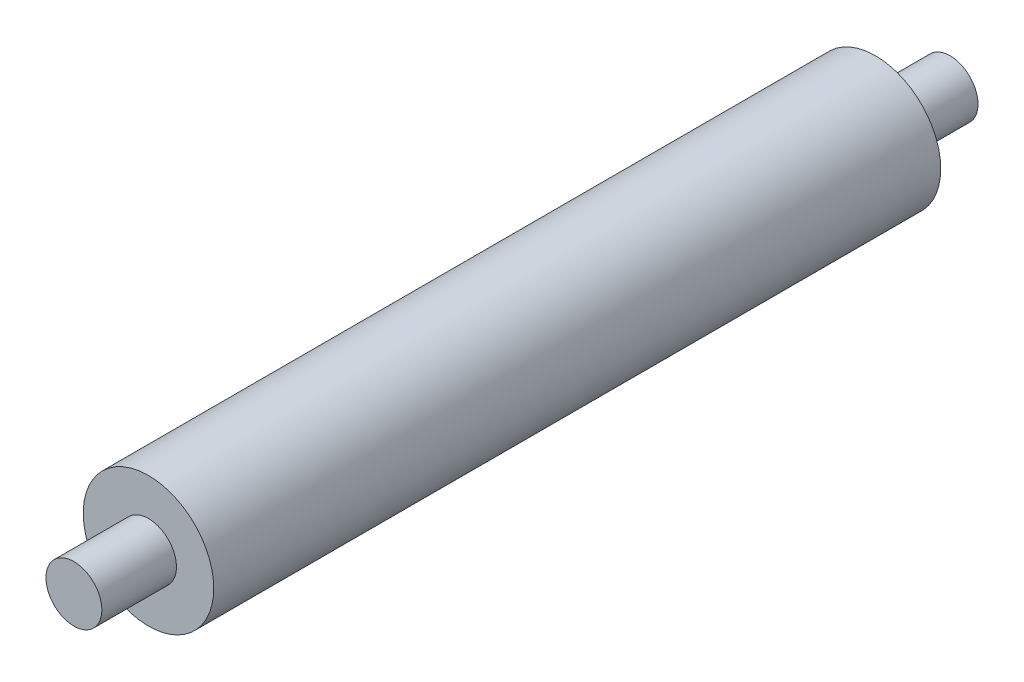
ISO-10303-21;
HEADER;
FILE_DESCRIPTION(('STEP AP214'),'2;1');
FILE_NAME('part.step','',(''),(''),'','','');
FILE_SCHEMA(('AUTOMOTIVE_DESIGN { 1 0 10303 214 1 1 1 1 }'));
ENDSEC;
DATA;
#1=APPLICATION_CONTEXT('core data for automotive mechanical design processes');
#2=APPLICATION_PROTOCOL_DEFINITION('international standard','automotive_design',2000,#1);
#3=PRODUCT_CONTEXT('',#1,'mechanical');
#4=PRODUCT('Part','Part','',(#3));
#5=PRODUCT_RELATED_PRODUCT_CATEGORY('part','',(#4));
#6=PRODUCT_DEFINITION_FORMATION('','',#4);
#7=PRODUCT_DEFINITION_CONTEXT('part definition',#1,'design');
#8=PRODUCT_DEFINITION('design','',#6,#7);
#9=PRODUCT_DEFINITION_SHAPE('','',#8);
#10=(LENGTH_UNIT() NAMED_UNIT(*) SI_UNIT(.MILLI.,.METRE.));
#11=(NAMED_UNIT(*) PLANE_ANGLE_UNIT() SI_UNIT($,.RADIAN.));
#12=(NAMED_UNIT(*) SI_UNIT($,.STERADIAN.) SOLID_ANGLE_UNIT());
#13=UNCERTAINTY_MEASURE_WITH_UNIT(LENGTH_MEASURE(1.E-05),#10,'distance_accuracy_value','');
#14=(GEOMETRIC_REPRESENTATION_CONTEXT(3) GLOBAL_UNCERTAINTY_ASSIGNED_CONTEXT((#13)) GLOBAL_UNIT_ASSIGNED_CONTEXT((#10,
#11,#12)) REPRESENTATION_CONTEXT('',''));
#15=CARTESIAN_POINT('',(0.,0.,0.));
#16=DIRECTION('',(0.,0.,1.));
#17=DIRECTION('',(1.,0.,0.));
#18=AXIS2_PLACEMENT_3D('',#15,#16,#17);
#19=CARTESIAN_POINT('',(0.,0.,39.));
#20=DIRECTION('',(0.,0.,-1.));
#21=DIRECTION('',(-1.,0.,0.));
#22=AXIS2_PLACEMENT_3D('',#19,#20,#21);
#23=CYLINDRICAL_SURFACE('',#22,3.5);
#24=CARTESIAN_POINT('',(0.,0.,39.));
#25=DIRECTION('',(0.,0.,1.));
#26=DIRECTION('',(1.,0.,0.));
#27=AXIS2_PLACEMENT_3D('',#24,#25,#26);
#28=CIRCLE('',#27,3.5);
#29=CARTESIAN_POINT('',(3.5,0.,39.));
#30=VERTEX_POINT('',#29);
#31=EDGE_CURVE('E40',#30,#30,#28,.T.);
#32=ORIENTED_EDGE('',*,*,#31,.F.);
#33=EDGE_LOOP('',(#32));
#34=FACE_BOUND('',#33,.T.);
#35=CARTESIAN_POINT('',(0.,0.,0.));
#36=DIRECTION('',(0.,0.,1.));
#37=DIRECTION('',(1.,0.,0.));
#38=AXIS2_PLACEMENT_3D('',#35,#36,#37);
#39=CIRCLE('',#38,3.5);
#40=CARTESIAN_POINT('',(3.5,0.,0.));
#41=VERTEX_POINT('',#40);
#42=EDGE_CURVE('E45',#41,#41,#39,.T.);
#43=ORIENTED_EDGE('',*,*,#42,.T.);
#44=EDGE_LOOP('',(#43));
#45=FACE_BOUND('',#44,.T.);
#46=ADVANCED_FACE('F33',(#34,#45),#23,.T.);
#47=CARTESIAN_POINT('',(0.,0.,39.));
#48=DIRECTION('',(0.,0.,1.));
#49=DIRECTION('',(1.,0.,0.));
#50=AXIS2_PLACEMENT_3D('',#47,#48,#49);
#51=PLANE('',#50);
#52=CARTESIAN_POINT('',(0.,0.,39.));
#53=DIRECTION('',(0.,0.,1.));
#54=DIRECTION('',(1.,0.,0.));
#55=AXIS2_PLACEMENT_3D('',#52,#53,#54);
#56=CIRCLE('',#55,1.5);
#57=CARTESIAN_POINT('',(1.5,0.,39.));
#58=VERTEX_POINT('',#57);
#59=EDGE_CURVE('E10',#58,#58,#56,.T.);
#60=ORIENTED_EDGE('',*,*,#59,.F.);
#61=EDGE_LOOP('',(#60));
#62=FACE_BOUND('',#61,.T.);
#63=ORIENTED_EDGE('',*,*,#31,.T.);
#64=EDGE_LOOP('',(#63));
#65=FACE_BOUND('',#64,.T.);
#66=ADVANCED_FACE('F78',(#62,#65),#51,.T.);
#67=CARTESIAN_POINT('',(0.,0.,0.));
#68=DIRECTION('',(0.,0.,1.));
#69=DIRECTION('',(1.,0.,0.));
#70=AXIS2_PLACEMENT_3D('',#67,#68,#69);
#71=PLANE('',#70);
#72=CARTESIAN_POINT('',(0.,0.,0.));
#73=DIRECTION('',(0.,0.,1.));
#74=DIRECTION('',(1.,0.,0.));
#75=AXIS2_PLACEMENT_3D('',#72,#73,#74);
#76=CIRCLE('',#75,1.5);
#77=CARTESIAN_POINT('',(1.5,0.,0.));
#78=VERTEX_POINT('',#77);
#79=EDGE_CURVE('E36',#78,#78,#76,.T.);
#80=ORIENTED_EDGE('',*,*,#79,.T.);
#81=EDGE_LOOP('',(#80));
#82=FACE_BOUND('',#81,.T.);
#83=ORIENTED_EDGE('',*,*,#42,.F.);
#84=EDGE_LOOP('',(#83));
#85=FACE_BOUND('',#84,.T.);
#86=ADVANCED_FACE('F83',(#82,#85),#71,.F.);
#87=CARTESIAN_POINT('',(0.,0.,-4.00000000000001));
#88=DIRECTION('',(0.,0.,1.));
#89=DIRECTION('',(1.,0.,0.));
#90=AXIS2_PLACEMENT_3D('',#87,#88,#89);
#91=PLANE('',#90);
#92=CARTESIAN_POINT('',(0.,0.,-4.00000000000001));
#93=DIRECTION('',(0.,0.,1.));
#94=DIRECTION('',(1.,0.,0.));
#95=AXIS2_PLACEMENT_3D('',#92,#93,#94);
#96=CIRCLE('',#95,1.5);
#97=CARTESIAN_POINT('',(1.5,0.,-4.00000000000001));
#98=VERTEX_POINT('',#97);
#99=EDGE_CURVE('E48',#98,#98,#96,.T.);
#100=ORIENTED_EDGE('',*,*,#99,.F.);
#101=EDGE_LOOP('',(#100));
#102=FACE_BOUND('',#101,.T.);
#103=ADVANCED_FACE('F74',(#102),#91,.F.);
#104=CARTESIAN_POINT('',(0.,0.,-4.00000000000001));
#105=DIRECTION('',(0.,0.,1.));
#106=DIRECTION('',(1.,0.,0.));
#107=AXIS2_PLACEMENT_3D('',#104,#105,#106);
#108=CYLINDRICAL_SURFACE('',#107,1.5);
#109=ORIENTED_EDGE('',*,*,#99,.T.);
#110=EDGE_LOOP('',(#109));
#111=FACE_BOUND('',#110,.T.);
#112=ORIENTED_EDGE('',*,*,#79,.F.);
#113=EDGE_LOOP('',(#112));
#114=FACE_BOUND('',#113,.T.);
#115=ADVANCED_FACE('F67',(#111,#114),#108,.T.);
#116=ORIENTED_EDGE('',*,*,#59,.T.);
#117=EDGE_LOOP('',(#116));
#118=FACE_BOUND('',#117,.T.);
#119=CARTESIAN_POINT('',(0.,0.,43.));
#120=DIRECTION('',(0.,0.,1.));
#121=DIRECTION('',(1.,0.,0.));
#122=AXIS2_PLACEMENT_3D('',#119,#120,#121);
#123=CIRCLE('',#122,1.5);
#124=CARTESIAN_POINT('',(1.5,0.,43.));
#125=VERTEX_POINT('',#124);
#126=EDGE_CURVE('E57',#125,#125,#123,.T.);
#127=ORIENTED_EDGE('',*,*,#126,.F.);
#128=EDGE_LOOP('',(#127));
#129=FACE_BOUND('',#128,.T.);
#130=ADVANCED_FACE('F65',(#118,#129),#108,.T.);
#131=CARTESIAN_POINT('',(0.,0.,43.));
#132=DIRECTION('',(0.,0.,1.));
#133=DIRECTION('',(1.,0.,0.));
#134=AXIS2_PLACEMENT_3D('',#131,#132,#133);
#135=PLANE('',#134);
#136=ORIENTED_EDGE('',*,*,#126,.T.);
#137=EDGE_LOOP('',(#136));
#138=FACE_BOUND('',#137,.T.);
#139=ADVANCED_FACE('F63',(#138),#135,.T.);
#140=CLOSED_SHELL('',(#46,#66,#86,#103,#115,#130,#139));
#141=MANIFOLD_SOLID_BREP('B2',#140);
#142=ADVANCED_BREP_SHAPE_REPRESENTATION('',(#18,#141),#14);
#143=SHAPE_DEFINITION_REPRESENTATION(#9,#142);
ENDSEC;
END-ISO-10303-21;
